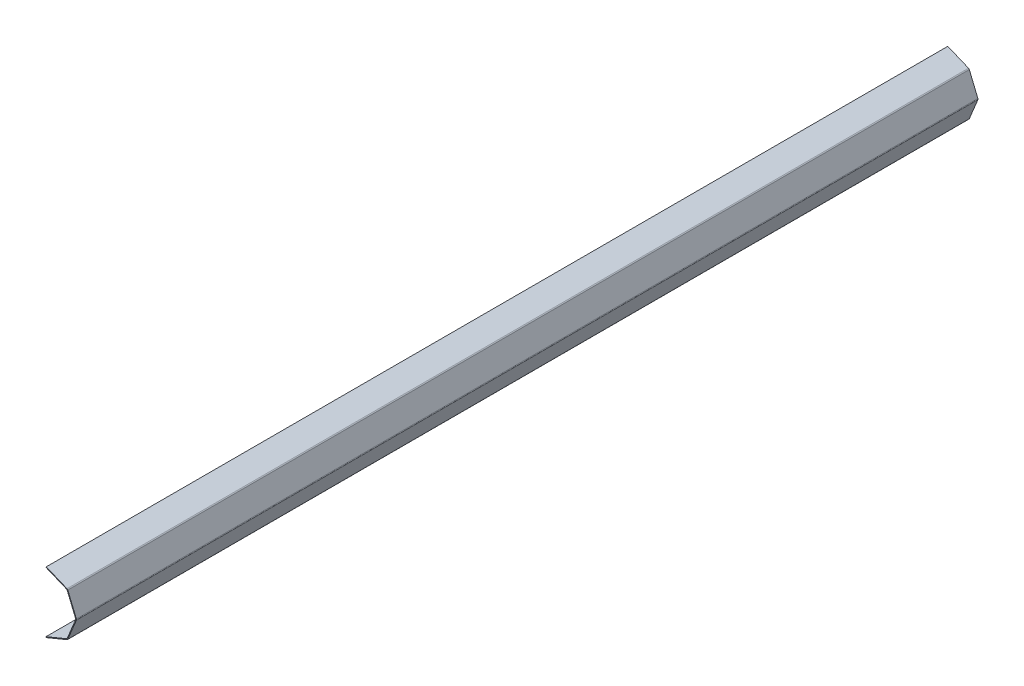
ISO-10303-21;
HEADER;
FILE_DESCRIPTION(('STEP AP214'),'2;1');
FILE_NAME('part.step','',(''),(''),'','','');
FILE_SCHEMA(('AUTOMOTIVE_DESIGN { 1 0 10303 214 1 1 1 1 }'));
ENDSEC;
DATA;
#1=APPLICATION_CONTEXT('core data for automotive mechanical design processes');
#2=APPLICATION_PROTOCOL_DEFINITION('international standard','automotive_design',2000,#1);
#3=PRODUCT_CONTEXT('',#1,'mechanical');
#4=PRODUCT('Part','Part','',(#3));
#5=PRODUCT_RELATED_PRODUCT_CATEGORY('part','',(#4));
#6=PRODUCT_DEFINITION_FORMATION('','',#4);
#7=PRODUCT_DEFINITION_CONTEXT('part definition',#1,'design');
#8=PRODUCT_DEFINITION('design','',#6,#7);
#9=PRODUCT_DEFINITION_SHAPE('','',#8);
#10=(LENGTH_UNIT() NAMED_UNIT(*) SI_UNIT(.MILLI.,.METRE.));
#11=(NAMED_UNIT(*) PLANE_ANGLE_UNIT() SI_UNIT($,.RADIAN.));
#12=(NAMED_UNIT(*) SI_UNIT($,.STERADIAN.) SOLID_ANGLE_UNIT());
#13=UNCERTAINTY_MEASURE_WITH_UNIT(LENGTH_MEASURE(1.E-05),#10,'distance_accuracy_value','');
#14=(GEOMETRIC_REPRESENTATION_CONTEXT(3) GLOBAL_UNCERTAINTY_ASSIGNED_CONTEXT((#13)) GLOBAL_UNIT_ASSIGNED_CONTEXT((#10,
#11,#12)) REPRESENTATION_CONTEXT('',''));
#15=CARTESIAN_POINT('',(0.,0.,0.));
#16=DIRECTION('',(0.,0.,1.));
#17=DIRECTION('',(1.,0.,0.));
#18=AXIS2_PLACEMENT_3D('',#15,#16,#17);
#19=CARTESIAN_POINT('',(139.507939075484,142.213919576215,5990.));
#20=DIRECTION('',(0.,0.,1.));
#21=DIRECTION('',(1.,0.,0.));
#22=AXIS2_PLACEMENT_3D('',#19,#20,#21);
#23=PLANE('',#22);
#24=DIRECTION('',(0.382683432365087,0.923879532511288,0.));
#25=VECTOR('',#24,1.);
#26=CARTESIAN_POINT('',(139.507939075484,142.213919576215,5990.));
#27=LINE('',#26,#25);
#28=CARTESIAN_POINT('',(139.507939075484,142.213919576215,5990.));
#29=VERTEX_POINT('',#28);
#30=CARTESIAN_POINT('',(141.42135623731,146.833317238771,5990.));
#31=VERTEX_POINT('',#30);
#32=EDGE_CURVE('E11',#29,#31,#27,.T.);
#33=ORIENTED_EDGE('',*,*,#32,.F.);
#34=CARTESIAN_POINT('',(137.594521913659,137.594521913659,5990.));
#35=DIRECTION('',(0.,0.,1.));
#36=DIRECTION('',(1.,0.,0.));
#37=AXIS2_PLACEMENT_3D('',#34,#35,#36);
#38=CIRCLE('',#37,5.);
#39=CARTESIAN_POINT('',(142.213919576215,139.507939075484,5990.));
#40=VERTEX_POINT('',#39);
#41=EDGE_CURVE('E306',#29,#40,#38,.F.);
#42=ORIENTED_EDGE('',*,*,#41,.T.);
#43=DIRECTION('',(-0.923879532511283,-0.382683432365099,0.));
#44=VECTOR('',#43,1.);
#45=CARTESIAN_POINT('',(146.833317238772,141.42135623731,5990.));
#46=LINE('',#45,#44);
#47=CARTESIAN_POINT('',(146.833317238772,141.42135623731,5990.));
#48=VERTEX_POINT('',#47);
#49=EDGE_CURVE('E47',#48,#40,#46,.T.);
#50=ORIENTED_EDGE('',*,*,#49,.F.);
#51=CARTESIAN_POINT('',(137.594521913659,137.594521913659,5990.));
#52=DIRECTION('',(0.,0.,1.));
#53=DIRECTION('',(1.,0.,0.));
#54=AXIS2_PLACEMENT_3D('',#51,#52,#53);
#55=CIRCLE('',#54,10.);
#56=EDGE_CURVE('E325',#31,#48,#55,.F.);
#57=ORIENTED_EDGE('',*,*,#56,.F.);
#58=EDGE_LOOP('',(#33,#42,#50,#57));
#59=FACE_BOUND('',#58,.T.);
#60=ADVANCED_FACE('F39',(#59),#23,.T.);
#61=CARTESIAN_POINT('',(146.833317238772,141.42135623731,5990.));
#62=DIRECTION('',(0.,0.,1.));
#63=DIRECTION('',(1.,0.,0.));
#64=AXIS2_PLACEMENT_3D('',#61,#62,#63);
#65=PLANE('',#64);
#66=DIRECTION('',(0.923879532511287,-0.38268343236509,0.));
#67=VECTOR('',#66,1.);
#68=CARTESIAN_POINT('',(1.91341716182544,199.207436661095,5990.));
#69=LINE('',#68,#67);
#70=CARTESIAN_POINT('',(1.91341716182544,199.207436661095,5990.));
#71=VERTEX_POINT('',#70);
#72=EDGE_CURVE('E310',#71,#29,#69,.T.);
#73=ORIENTED_EDGE('',*,*,#72,.T.);
#74=ORIENTED_EDGE('',*,*,#32,.T.);
#75=DIRECTION('',(0.923879532511287,-0.38268343236509,0.));
#76=VECTOR('',#75,1.);
#77=CARTESIAN_POINT('',(3.82683432365089,203.826834323651,5990.));
#78=LINE('',#77,#76);
#79=CARTESIAN_POINT('',(3.82683432365089,203.826834323651,5990.));
#80=VERTEX_POINT('',#79);
#81=EDGE_CURVE('E322',#80,#31,#78,.T.);
#82=ORIENTED_EDGE('',*,*,#81,.F.);
#83=DIRECTION('',(0.382683432365091,0.923879532511286,0.));
#84=VECTOR('',#83,1.);
#85=CARTESIAN_POINT('',(1.91341716182544,199.207436661095,5990.));
#86=LINE('',#85,#84);
#87=EDGE_CURVE('E319',#71,#80,#86,.T.);
#88=ORIENTED_EDGE('',*,*,#87,.F.);
#89=EDGE_LOOP('',(#73,#74,#82,#88));
#90=FACE_BOUND('',#89,.T.);
#91=ADVANCED_FACE('F375',(#90),#65,.T.);
#92=CARTESIAN_POINT('',(142.213919576215,139.507939075484,0.));
#93=DIRECTION('',(0.,0.,-1.));
#94=DIRECTION('',(-1.,0.,0.));
#95=AXIS2_PLACEMENT_3D('',#92,#93,#94);
#96=PLANE('',#95);
#97=DIRECTION('',(0.923879532511283,0.382683432365099,0.));
#98=VECTOR('',#97,1.);
#99=CARTESIAN_POINT('',(142.213919576215,139.507939075484,0.));
#100=LINE('',#99,#98);
#101=CARTESIAN_POINT('',(142.213919576215,139.507939075484,0.));
#102=VERTEX_POINT('',#101);
#103=CARTESIAN_POINT('',(146.833317238772,141.42135623731,0.));
#104=VERTEX_POINT('',#103);
#105=EDGE_CURVE('E292',#102,#104,#100,.T.);
#106=ORIENTED_EDGE('',*,*,#105,.F.);
#107=CARTESIAN_POINT('',(137.594521913659,137.594521913659,0.));
#108=DIRECTION('',(0.,0.,1.));
#109=DIRECTION('',(1.,0.,0.));
#110=AXIS2_PLACEMENT_3D('',#107,#108,#109);
#111=CIRCLE('',#110,5.);
#112=CARTESIAN_POINT('',(139.507939075484,142.213919576215,0.));
#113=VERTEX_POINT('',#112);
#114=EDGE_CURVE('E234',#113,#102,#111,.F.);
#115=ORIENTED_EDGE('',*,*,#114,.F.);
#116=DIRECTION('',(-0.382683432365087,-0.923879532511288,0.));
#117=VECTOR('',#116,1.);
#118=CARTESIAN_POINT('',(141.42135623731,146.833317238771,0.));
#119=LINE('',#118,#117);
#120=CARTESIAN_POINT('',(141.42135623731,146.833317238771,0.));
#121=VERTEX_POINT('',#120);
#122=EDGE_CURVE('E290',#121,#113,#119,.T.);
#123=ORIENTED_EDGE('',*,*,#122,.F.);
#124=CARTESIAN_POINT('',(137.594521913659,137.594521913659,0.));
#125=DIRECTION('',(0.,0.,1.));
#126=DIRECTION('',(1.,0.,0.));
#127=AXIS2_PLACEMENT_3D('',#124,#125,#126);
#128=CIRCLE('',#127,10.);
#129=EDGE_CURVE('E222',#121,#104,#128,.F.);
#130=ORIENTED_EDGE('',*,*,#129,.T.);
#131=EDGE_LOOP('',(#106,#115,#123,#130));
#132=FACE_BOUND('',#131,.T.);
#133=ADVANCED_FACE('F385',(#132),#96,.T.);
#134=CARTESIAN_POINT('',(141.42135623731,146.833317238771,0.));
#135=DIRECTION('',(0.,0.,-1.));
#136=DIRECTION('',(-1.,0.,0.));
#137=AXIS2_PLACEMENT_3D('',#134,#135,#136);
#138=PLANE('',#137);
#139=DIRECTION('',(0.38268343236509,-0.923879532511287,0.));
#140=VECTOR('',#139,1.);
#141=CARTESIAN_POINT('',(200.,0.,0.));
#142=LINE('',#141,#140);
#143=CARTESIAN_POINT('',(199.207436661095,1.91341716182545,0.));
#144=VERTEX_POINT('',#143);
#145=EDGE_CURVE('E237',#102,#144,#142,.T.);
#146=ORIENTED_EDGE('',*,*,#145,.F.);
#147=ORIENTED_EDGE('',*,*,#105,.T.);
#148=DIRECTION('',(0.38268343236509,-0.923879532511287,0.));
#149=VECTOR('',#148,1.);
#150=CARTESIAN_POINT('',(204.619397662556,1.91341716182546,0.));
#151=LINE('',#150,#149);
#152=CARTESIAN_POINT('',(203.826834323651,3.82683432365091,0.));
#153=VERTEX_POINT('',#152);
#154=EDGE_CURVE('E219',#104,#153,#151,.T.);
#155=ORIENTED_EDGE('',*,*,#154,.T.);
#156=DIRECTION('',(-0.923879532511287,-0.38268343236509,0.));
#157=VECTOR('',#156,1.);
#158=CARTESIAN_POINT('',(203.826834323651,3.82683432365091,0.));
#159=LINE('',#158,#157);
#160=EDGE_CURVE('E286',#153,#144,#159,.T.);
#161=ORIENTED_EDGE('',*,*,#160,.T.);
#162=EDGE_LOOP('',(#146,#147,#155,#161));
#163=FACE_BOUND('',#162,.T.);
#164=ADVANCED_FACE('F387',(#163),#138,.T.);
#165=CARTESIAN_POINT('',(199.207436661095,1.91341716182545,5990.));
#166=DIRECTION('',(0.,0.,1.));
#167=DIRECTION('',(1.,0.,0.));
#168=AXIS2_PLACEMENT_3D('',#165,#166,#167);
#169=PLANE('',#168);
#170=DIRECTION('',(0.923879532511287,0.38268343236509,0.));
#171=VECTOR('',#170,1.);
#172=CARTESIAN_POINT('',(199.207436661095,1.91341716182545,5990.));
#173=LINE('',#172,#171);
#174=CARTESIAN_POINT('',(199.207436661095,1.91341716182545,5990.));
#175=VERTEX_POINT('',#174);
#176=CARTESIAN_POINT('',(203.826834323651,3.82683432365091,5990.));
#177=VERTEX_POINT('',#176);
#178=EDGE_CURVE('E172',#175,#177,#173,.T.);
#179=ORIENTED_EDGE('',*,*,#178,.F.);
#180=CARTESIAN_POINT('',(194.588038998538,0.,5990.));
#181=DIRECTION('',(0.,0.,1.));
#182=DIRECTION('',(1.,0.,0.));
#183=AXIS2_PLACEMENT_3D('',#180,#181,#182);
#184=CIRCLE('',#183,5.);
#185=CARTESIAN_POINT('',(199.207436661094,-1.9134171618255,5990.));
#186=VERTEX_POINT('',#185);
#187=EDGE_CURVE('E176',#175,#186,#184,.F.);
#188=ORIENTED_EDGE('',*,*,#187,.T.);
#189=DIRECTION('',(-0.923879532511287,0.382683432365089,0.));
#190=VECTOR('',#189,1.);
#191=CARTESIAN_POINT('',(203.826834323651,-3.82683432365094,5990.));
#192=LINE('',#191,#190);
#193=CARTESIAN_POINT('',(203.826834323651,-3.82683432365094,5990.));
#194=VERTEX_POINT('',#193);
#195=EDGE_CURVE('E160',#194,#186,#192,.T.);
#196=ORIENTED_EDGE('',*,*,#195,.F.);
#197=CARTESIAN_POINT('',(194.588038998538,0.,5990.));
#198=DIRECTION('',(0.,0.,1.));
#199=DIRECTION('',(1.,0.,0.));
#200=AXIS2_PLACEMENT_3D('',#197,#198,#199);
#201=CIRCLE('',#200,10.);
#202=EDGE_CURVE('E328',#177,#194,#201,.F.);
#203=ORIENTED_EDGE('',*,*,#202,.F.);
#204=EDGE_LOOP('',(#179,#188,#196,#203));
#205=FACE_BOUND('',#204,.T.);
#206=ADVANCED_FACE('F178',(#205),#169,.T.);
#207=CARTESIAN_POINT('',(203.826834323651,-3.82683432365094,5990.));
#208=DIRECTION('',(0.,0.,1.));
#209=DIRECTION('',(1.,0.,0.));
#210=AXIS2_PLACEMENT_3D('',#207,#208,#209);
#211=PLANE('',#210);
#212=DIRECTION('',(0.38268343236509,-0.923879532511287,0.));
#213=VECTOR('',#212,1.);
#214=CARTESIAN_POINT('',(200.,0.,5990.));
#215=LINE('',#214,#213);
#216=EDGE_CURVE('E182',#40,#175,#215,.T.);
#217=ORIENTED_EDGE('',*,*,#216,.T.);
#218=ORIENTED_EDGE('',*,*,#178,.T.);
#219=DIRECTION('',(0.38268343236509,-0.923879532511287,0.));
#220=VECTOR('',#219,1.);
#221=CARTESIAN_POINT('',(204.619397662556,1.91341716182546,5990.));
#222=LINE('',#221,#220);
#223=EDGE_CURVE('E300',#48,#177,#222,.T.);
#224=ORIENTED_EDGE('',*,*,#223,.F.);
#225=ORIENTED_EDGE('',*,*,#49,.T.);
#226=EDGE_LOOP('',(#217,#218,#224,#225));
#227=FACE_BOUND('',#226,.T.);
#228=ADVANCED_FACE('F296',(#227),#211,.T.);
#229=CARTESIAN_POINT('',(199.207436661094,-1.9134171618255,0.));
#230=DIRECTION('',(0.,0.,-1.));
#231=DIRECTION('',(-1.,0.,0.));
#232=AXIS2_PLACEMENT_3D('',#229,#230,#231);
#233=PLANE('',#232);
#234=DIRECTION('',(0.923879532511287,-0.382683432365089,0.));
#235=VECTOR('',#234,1.);
#236=CARTESIAN_POINT('',(199.207436661094,-1.9134171618255,0.));
#237=LINE('',#236,#235);
#238=CARTESIAN_POINT('',(199.207436661094,-1.9134171618255,0.));
#239=VERTEX_POINT('',#238);
#240=CARTESIAN_POINT('',(203.826834323651,-3.82683432365094,0.));
#241=VERTEX_POINT('',#240);
#242=EDGE_CURVE('E173',#239,#241,#237,.T.);
#243=ORIENTED_EDGE('',*,*,#242,.F.);
#244=CARTESIAN_POINT('',(194.588038998538,0.,0.));
#245=DIRECTION('',(0.,0.,1.));
#246=DIRECTION('',(1.,0.,0.));
#247=AXIS2_PLACEMENT_3D('',#244,#245,#246);
#248=CIRCLE('',#247,5.);
#249=EDGE_CURVE('E189',#144,#239,#248,.F.);
#250=ORIENTED_EDGE('',*,*,#249,.F.);
#251=ORIENTED_EDGE('',*,*,#160,.F.);
#252=CARTESIAN_POINT('',(194.588038998538,0.,0.));
#253=DIRECTION('',(0.,0.,1.));
#254=DIRECTION('',(1.,0.,0.));
#255=AXIS2_PLACEMENT_3D('',#252,#253,#254);
#256=CIRCLE('',#255,10.);
#257=EDGE_CURVE('E216',#153,#241,#256,.F.);
#258=ORIENTED_EDGE('',*,*,#257,.T.);
#259=EDGE_LOOP('',(#243,#250,#251,#258));
#260=FACE_BOUND('',#259,.T.);
#261=ADVANCED_FACE('F389',(#260),#233,.T.);
#262=CARTESIAN_POINT('',(203.826834323651,3.82683432365091,0.));
#263=DIRECTION('',(0.,0.,-1.));
#264=DIRECTION('',(-1.,0.,0.));
#265=AXIS2_PLACEMENT_3D('',#262,#263,#264);
#266=PLANE('',#265);
#267=DIRECTION('',(-0.38268343236509,-0.923879532511287,0.));
#268=VECTOR('',#267,1.);
#269=CARTESIAN_POINT('',(141.42135623731,-141.42135623731,0.));
#270=LINE('',#269,#268);
#271=CARTESIAN_POINT('',(142.213919576215,-139.507939075484,0.));
#272=VERTEX_POINT('',#271);
#273=EDGE_CURVE('E241',#239,#272,#270,.T.);
#274=ORIENTED_EDGE('',*,*,#273,.F.);
#275=ORIENTED_EDGE('',*,*,#242,.T.);
#276=DIRECTION('',(-0.38268343236509,-0.923879532511287,0.));
#277=VECTOR('',#276,1.);
#278=CARTESIAN_POINT('',(146.040753899866,-143.334773399135,0.));
#279=LINE('',#278,#277);
#280=CARTESIAN_POINT('',(146.833317238772,-141.42135623731,0.));
#281=VERTEX_POINT('',#280);
#282=EDGE_CURVE('E214',#241,#281,#279,.T.);
#283=ORIENTED_EDGE('',*,*,#282,.T.);
#284=DIRECTION('',(-0.923879532511288,0.382683432365087,0.));
#285=VECTOR('',#284,1.);
#286=CARTESIAN_POINT('',(146.833317238772,-141.42135623731,0.));
#287=LINE('',#286,#285);
#288=EDGE_CURVE('E108',#281,#272,#287,.T.);
#289=ORIENTED_EDGE('',*,*,#288,.T.);
#290=EDGE_LOOP('',(#274,#275,#283,#289));
#291=FACE_BOUND('',#290,.T.);
#292=ADVANCED_FACE('F390',(#291),#266,.T.);
#293=CARTESIAN_POINT('',(142.213919576215,-139.507939075484,5990.));
#294=DIRECTION('',(0.,0.,1.));
#295=DIRECTION('',(1.,0.,0.));
#296=AXIS2_PLACEMENT_3D('',#293,#294,#295);
#297=PLANE('',#296);
#298=DIRECTION('',(0.923879532511288,-0.382683432365087,0.));
#299=VECTOR('',#298,1.);
#300=CARTESIAN_POINT('',(142.213919576215,-139.507939075484,5990.));
#301=LINE('',#300,#299);
#302=CARTESIAN_POINT('',(142.213919576215,-139.507939075484,5990.));
#303=VERTEX_POINT('',#302);
#304=CARTESIAN_POINT('',(146.833317238772,-141.42135623731,5990.));
#305=VERTEX_POINT('',#304);
#306=EDGE_CURVE('E284',#303,#305,#301,.T.);
#307=ORIENTED_EDGE('',*,*,#306,.F.);
#308=CARTESIAN_POINT('',(137.594521913659,-137.594521913659,5990.));
#309=DIRECTION('',(0.,0.,1.));
#310=DIRECTION('',(1.,0.,0.));
#311=AXIS2_PLACEMENT_3D('',#308,#309,#310);
#312=CIRCLE('',#311,5.);
#313=CARTESIAN_POINT('',(139.507939075484,-142.213919576215,5990.));
#314=VERTEX_POINT('',#313);
#315=EDGE_CURVE('E197',#303,#314,#312,.F.);
#316=ORIENTED_EDGE('',*,*,#315,.T.);
#317=DIRECTION('',(-0.382683432365089,0.923879532511287,0.));
#318=VECTOR('',#317,1.);
#319=CARTESIAN_POINT('',(141.42135623731,-146.833317238772,5990.));
#320=LINE('',#319,#318);
#321=CARTESIAN_POINT('',(141.42135623731,-146.833317238772,5990.));
#322=VERTEX_POINT('',#321);
#323=EDGE_CURVE('E55',#322,#314,#320,.T.);
#324=ORIENTED_EDGE('',*,*,#323,.F.);
#325=CARTESIAN_POINT('',(137.594521913659,-137.594521913659,5990.));
#326=DIRECTION('',(0.,0.,1.));
#327=DIRECTION('',(1.,0.,0.));
#328=AXIS2_PLACEMENT_3D('',#325,#326,#327);
#329=CIRCLE('',#328,10.);
#330=EDGE_CURVE('E331',#305,#322,#329,.F.);
#331=ORIENTED_EDGE('',*,*,#330,.F.);
#332=EDGE_LOOP('',(#307,#316,#324,#331));
#333=FACE_BOUND('',#332,.T.);
#334=ADVANCED_FACE('F354',(#333),#297,.T.);
#335=CARTESIAN_POINT('',(141.42135623731,-146.833317238772,5990.));
#336=DIRECTION('',(0.,0.,1.));
#337=DIRECTION('',(1.,0.,0.));
#338=AXIS2_PLACEMENT_3D('',#335,#336,#337);
#339=PLANE('',#338);
#340=DIRECTION('',(-0.38268343236509,-0.923879532511287,0.));
#341=VECTOR('',#340,1.);
#342=CARTESIAN_POINT('',(141.42135623731,-141.42135623731,5990.));
#343=LINE('',#342,#341);
#344=EDGE_CURVE('E164',#186,#303,#343,.T.);
#345=ORIENTED_EDGE('',*,*,#344,.T.);
#346=ORIENTED_EDGE('',*,*,#306,.T.);
#347=DIRECTION('',(-0.38268343236509,-0.923879532511287,0.));
#348=VECTOR('',#347,1.);
#349=CARTESIAN_POINT('',(146.040753899866,-143.334773399135,5990.));
#350=LINE('',#349,#348);
#351=EDGE_CURVE('E167',#194,#305,#350,.T.);
#352=ORIENTED_EDGE('',*,*,#351,.F.);
#353=ORIENTED_EDGE('',*,*,#195,.T.);
#354=EDGE_LOOP('',(#345,#346,#352,#353));
#355=FACE_BOUND('',#354,.T.);
#356=ADVANCED_FACE('F162',(#355),#339,.T.);
#357=CARTESIAN_POINT('',(139.507939075484,-142.213919576215,0.));
#358=DIRECTION('',(0.,0.,-1.));
#359=DIRECTION('',(-1.,0.,0.));
#360=AXIS2_PLACEMENT_3D('',#357,#358,#359);
#361=PLANE('',#360);
#362=DIRECTION('',(0.382683432365089,-0.923879532511287,0.));
#363=VECTOR('',#362,1.);
#364=CARTESIAN_POINT('',(139.507939075484,-142.213919576215,0.));
#365=LINE('',#364,#363);
#366=CARTESIAN_POINT('',(139.507939075484,-142.213919576215,0.));
#367=VERTEX_POINT('',#366);
#368=CARTESIAN_POINT('',(141.42135623731,-146.833317238772,0.));
#369=VERTEX_POINT('',#368);
#370=EDGE_CURVE('E115',#367,#369,#365,.T.);
#371=ORIENTED_EDGE('',*,*,#370,.F.);
#372=CARTESIAN_POINT('',(137.594521913659,-137.594521913659,0.));
#373=DIRECTION('',(0.,0.,1.));
#374=DIRECTION('',(1.,0.,0.));
#375=AXIS2_PLACEMENT_3D('',#372,#373,#374);
#376=CIRCLE('',#375,5.);
#377=EDGE_CURVE('E243',#272,#367,#376,.F.);
#378=ORIENTED_EDGE('',*,*,#377,.F.);
#379=ORIENTED_EDGE('',*,*,#288,.F.);
#380=CARTESIAN_POINT('',(137.594521913659,-137.594521913659,0.));
#381=DIRECTION('',(0.,0.,1.));
#382=DIRECTION('',(1.,0.,0.));
#383=AXIS2_PLACEMENT_3D('',#380,#381,#382);
#384=CIRCLE('',#383,10.);
#385=EDGE_CURVE('E212',#281,#369,#384,.F.);
#386=ORIENTED_EDGE('',*,*,#385,.T.);
#387=EDGE_LOOP('',(#371,#378,#379,#386));
#388=FACE_BOUND('',#387,.T.);
#389=ADVANCED_FACE('F394',(#388),#361,.T.);
#390=CARTESIAN_POINT('',(146.833317238772,-141.42135623731,0.));
#391=DIRECTION('',(0.,0.,-1.));
#392=DIRECTION('',(-1.,0.,0.));
#393=AXIS2_PLACEMENT_3D('',#390,#391,#392);
#394=PLANE('',#393);
#395=DIRECTION('',(-0.923879532511287,-0.382683432365089,0.));
#396=VECTOR('',#395,1.);
#397=CARTESIAN_POINT('',(141.42135623731,-141.42135623731,0.));
#398=LINE('',#397,#396);
#399=CARTESIAN_POINT('',(1.91341716182541,-199.207436661094,0.));
#400=VERTEX_POINT('',#399);
#401=EDGE_CURVE('E203',#367,#400,#398,.T.);
#402=ORIENTED_EDGE('',*,*,#401,.F.);
#403=ORIENTED_EDGE('',*,*,#370,.T.);
#404=DIRECTION('',(-0.923879532511287,-0.382683432365089,0.));
#405=VECTOR('',#404,1.);
#406=CARTESIAN_POINT('',(143.334773399135,-146.040753899866,0.));
#407=LINE('',#406,#405);
#408=CARTESIAN_POINT('',(3.82683432365083,-203.826834323651,0.));
#409=VERTEX_POINT('',#408);
#410=EDGE_CURVE('E209',#369,#409,#407,.T.);
#411=ORIENTED_EDGE('',*,*,#410,.T.);
#412=DIRECTION('',(-0.382683432365086,0.923879532511288,0.));
#413=VECTOR('',#412,1.);
#414=CARTESIAN_POINT('',(3.82683432365083,-203.826834323651,0.));
#415=LINE('',#414,#413);
#416=EDGE_CURVE('E206',#409,#400,#415,.T.);
#417=ORIENTED_EDGE('',*,*,#416,.T.);
#418=EDGE_LOOP('',(#402,#403,#411,#417));
#419=FACE_BOUND('',#418,.T.);
#420=ADVANCED_FACE('F396',(#419),#394,.T.);
#421=CARTESIAN_POINT('',(141.42135623731,-141.42135623731,5990.));
#422=DIRECTION('',(0.382683432365089,-0.923879532511287,0.));
#423=DIRECTION('',(0.923879532511287,0.382683432365089,0.));
#424=AXIS2_PLACEMENT_3D('',#421,#422,#423);
#425=PLANE('',#424);
#426=ORIENTED_EDGE('',*,*,#401,.T.);
#427=DIRECTION('',(0.,0.,-1.));
#428=VECTOR('',#427,1.);
#429=CARTESIAN_POINT('',(1.91341716182541,-199.207436661094,5990.));
#430=LINE('',#429,#428);
#431=CARTESIAN_POINT('',(1.91341716182541,-199.207436661094,5990.));
#432=VERTEX_POINT('',#431);
#433=EDGE_CURVE('E279',#432,#400,#430,.T.);
#434=ORIENTED_EDGE('',*,*,#433,.F.);
#435=DIRECTION('',(-0.923879532511287,-0.382683432365089,0.));
#436=VECTOR('',#435,1.);
#437=CARTESIAN_POINT('',(141.42135623731,-141.42135623731,5990.));
#438=LINE('',#437,#436);
#439=EDGE_CURVE('E121',#314,#432,#438,.T.);
#440=ORIENTED_EDGE('',*,*,#439,.F.);
#441=DIRECTION('',(0.,0.,-1.));
#442=VECTOR('',#441,1.);
#443=CARTESIAN_POINT('',(139.507939075484,-142.213919576215,5990.));
#444=LINE('',#443,#442);
#445=EDGE_CURVE('E199',#314,#367,#444,.T.);
#446=ORIENTED_EDGE('',*,*,#445,.T.);
#447=EDGE_LOOP('',(#426,#434,#440,#446));
#448=FACE_BOUND('',#447,.T.);
#449=ADVANCED_FACE('F402',(#448),#425,.F.);
#450=CARTESIAN_POINT('',(3.82683432365083,-203.826834323651,5990.));
#451=DIRECTION('',(-0.923879532511288,-0.382683432365086,0.));
#452=DIRECTION('',(0.382683432365086,-0.923879532511288,0.));
#453=AXIS2_PLACEMENT_3D('',#450,#451,#452);
#454=PLANE('',#453);
#455=ORIENTED_EDGE('',*,*,#416,.F.);
#456=DIRECTION('',(0.,0.,-1.));
#457=VECTOR('',#456,1.);
#458=CARTESIAN_POINT('',(3.82683432365083,-203.826834323651,5990.));
#459=LINE('',#458,#457);
#460=CARTESIAN_POINT('',(3.82683432365083,-203.826834323651,5990.));
#461=VERTEX_POINT('',#460);
#462=EDGE_CURVE('E277',#461,#409,#459,.T.);
#463=ORIENTED_EDGE('',*,*,#462,.F.);
#464=DIRECTION('',(-0.382683432365086,0.923879532511288,0.));
#465=VECTOR('',#464,1.);
#466=CARTESIAN_POINT('',(3.82683432365083,-203.826834323651,5990.));
#467=LINE('',#466,#465);
#468=EDGE_CURVE('E337',#461,#432,#467,.T.);
#469=ORIENTED_EDGE('',*,*,#468,.T.);
#470=ORIENTED_EDGE('',*,*,#433,.T.);
#471=EDGE_LOOP('',(#455,#463,#469,#470));
#472=FACE_BOUND('',#471,.T.);
#473=ADVANCED_FACE('F342',(#472),#454,.T.);
#474=CARTESIAN_POINT('',(143.334773399135,-146.040753899866,5990.));
#475=DIRECTION('',(0.382683432365089,-0.923879532511287,0.));
#476=DIRECTION('',(0.923879532511287,0.382683432365089,0.));
#477=AXIS2_PLACEMENT_3D('',#474,#475,#476);
#478=PLANE('',#477);
#479=ORIENTED_EDGE('',*,*,#410,.F.);
#480=DIRECTION('',(0.,0.,-1.));
#481=VECTOR('',#480,1.);
#482=CARTESIAN_POINT('',(141.42135623731,-146.833317238772,5990.));
#483=LINE('',#482,#481);
#484=EDGE_CURVE('E274',#322,#369,#483,.T.);
#485=ORIENTED_EDGE('',*,*,#484,.F.);
#486=DIRECTION('',(-0.923879532511287,-0.382683432365089,0.));
#487=VECTOR('',#486,1.);
#488=CARTESIAN_POINT('',(143.334773399135,-146.040753899866,5990.));
#489=LINE('',#488,#487);
#490=EDGE_CURVE('E334',#322,#461,#489,.T.);
#491=ORIENTED_EDGE('',*,*,#490,.T.);
#492=ORIENTED_EDGE('',*,*,#462,.T.);
#493=EDGE_LOOP('',(#479,#485,#491,#492));
#494=FACE_BOUND('',#493,.T.);
#495=ADVANCED_FACE('F347',(#494),#478,.T.);
#496=CARTESIAN_POINT('',(137.594521913659,-137.594521913659,5990.));
#497=DIRECTION('',(0.,0.,-1.));
#498=DIRECTION('',(-1.,0.,0.));
#499=AXIS2_PLACEMENT_3D('',#496,#497,#498);
#500=CYLINDRICAL_SURFACE('',#499,10.);
#501=ORIENTED_EDGE('',*,*,#385,.F.);
#502=DIRECTION('',(0.,0.,-1.));
#503=VECTOR('',#502,1.);
#504=CARTESIAN_POINT('',(146.833317238772,-141.42135623731,5990.));
#505=LINE('',#504,#503);
#506=EDGE_CURVE('E271',#305,#281,#505,.T.);
#507=ORIENTED_EDGE('',*,*,#506,.F.);
#508=ORIENTED_EDGE('',*,*,#330,.T.);
#509=ORIENTED_EDGE('',*,*,#484,.T.);
#510=EDGE_LOOP('',(#501,#507,#508,#509));
#511=FACE_BOUND('',#510,.T.);
#512=ADVANCED_FACE('F350',(#511),#500,.T.);
#513=CARTESIAN_POINT('',(146.040753899866,-143.334773399135,5990.));
#514=DIRECTION('',(0.923879532511287,-0.38268343236509,0.));
#515=DIRECTION('',(0.38268343236509,0.923879532511287,0.));
#516=AXIS2_PLACEMENT_3D('',#513,#514,#515);
#517=PLANE('',#516);
#518=ORIENTED_EDGE('',*,*,#282,.F.);
#519=DIRECTION('',(0.,0.,-1.));
#520=VECTOR('',#519,1.);
#521=CARTESIAN_POINT('',(203.826834323651,-3.82683432365094,5990.));
#522=LINE('',#521,#520);
#523=EDGE_CURVE('E268',#194,#241,#522,.T.);
#524=ORIENTED_EDGE('',*,*,#523,.F.);
#525=ORIENTED_EDGE('',*,*,#351,.T.);
#526=ORIENTED_EDGE('',*,*,#506,.T.);
#527=EDGE_LOOP('',(#518,#524,#525,#526));
#528=FACE_BOUND('',#527,.T.);
#529=ADVANCED_FACE('F357',(#528),#517,.T.);
#530=CARTESIAN_POINT('',(194.588038998538,0.,5990.));
#531=DIRECTION('',(0.,0.,-1.));
#532=DIRECTION('',(-1.,0.,0.));
#533=AXIS2_PLACEMENT_3D('',#530,#531,#532);
#534=CYLINDRICAL_SURFACE('',#533,10.);
#535=ORIENTED_EDGE('',*,*,#257,.F.);
#536=DIRECTION('',(0.,0.,-1.));
#537=VECTOR('',#536,1.);
#538=CARTESIAN_POINT('',(203.826834323651,3.82683432365091,5990.));
#539=LINE('',#538,#537);
#540=EDGE_CURVE('E265',#177,#153,#539,.T.);
#541=ORIENTED_EDGE('',*,*,#540,.F.);
#542=ORIENTED_EDGE('',*,*,#202,.T.);
#543=ORIENTED_EDGE('',*,*,#523,.T.);
#544=EDGE_LOOP('',(#535,#541,#542,#543));
#545=FACE_BOUND('',#544,.T.);
#546=ADVANCED_FACE('F360',(#545),#534,.T.);
#547=CARTESIAN_POINT('',(204.619397662556,1.91341716182546,5990.));
#548=DIRECTION('',(0.923879532511287,0.38268343236509,0.));
#549=DIRECTION('',(-0.38268343236509,0.923879532511287,0.));
#550=AXIS2_PLACEMENT_3D('',#547,#548,#549);
#551=PLANE('',#550);
#552=ORIENTED_EDGE('',*,*,#154,.F.);
#553=DIRECTION('',(0.,0.,-1.));
#554=VECTOR('',#553,1.);
#555=CARTESIAN_POINT('',(146.833317238772,141.42135623731,5990.));
#556=LINE('',#555,#554);
#557=EDGE_CURVE('E262',#48,#104,#556,.T.);
#558=ORIENTED_EDGE('',*,*,#557,.F.);
#559=ORIENTED_EDGE('',*,*,#223,.T.);
#560=ORIENTED_EDGE('',*,*,#540,.T.);
#561=EDGE_LOOP('',(#552,#558,#559,#560));
#562=FACE_BOUND('',#561,.T.);
#563=ADVANCED_FACE('F364',(#562),#551,.T.);
#564=CARTESIAN_POINT('',(137.594521913659,137.594521913659,5990.));
#565=DIRECTION('',(0.,0.,-1.));
#566=DIRECTION('',(-1.,0.,0.));
#567=AXIS2_PLACEMENT_3D('',#564,#565,#566);
#568=CYLINDRICAL_SURFACE('',#567,10.);
#569=ORIENTED_EDGE('',*,*,#129,.F.);
#570=DIRECTION('',(0.,0.,-1.));
#571=VECTOR('',#570,1.);
#572=CARTESIAN_POINT('',(141.42135623731,146.833317238771,5990.));
#573=LINE('',#572,#571);
#574=EDGE_CURVE('E259',#31,#121,#573,.T.);
#575=ORIENTED_EDGE('',*,*,#574,.F.);
#576=ORIENTED_EDGE('',*,*,#56,.T.);
#577=ORIENTED_EDGE('',*,*,#557,.T.);
#578=EDGE_LOOP('',(#569,#575,#576,#577));
#579=FACE_BOUND('',#578,.T.);
#580=ADVANCED_FACE('F367',(#579),#568,.T.);
#581=CARTESIAN_POINT('',(3.82683432365089,203.826834323651,5990.));
#582=DIRECTION('',(0.38268343236509,0.923879532511287,0.));
#583=DIRECTION('',(-0.923879532511287,0.38268343236509,0.));
#584=AXIS2_PLACEMENT_3D('',#581,#582,#583);
#585=PLANE('',#584);
#586=DIRECTION('',(0.923879532511287,-0.38268343236509,0.));
#587=VECTOR('',#586,1.);
#588=CARTESIAN_POINT('',(3.82683432365089,203.826834323651,0.));
#589=LINE('',#588,#587);
#590=CARTESIAN_POINT('',(3.82683432365089,203.826834323651,0.));
#591=VERTEX_POINT('',#590);
#592=EDGE_CURVE('E225',#591,#121,#589,.T.);
#593=ORIENTED_EDGE('',*,*,#592,.F.);
#594=DIRECTION('',(0.,0.,-1.));
#595=VECTOR('',#594,1.);
#596=CARTESIAN_POINT('',(3.82683432365089,203.826834323651,5990.));
#597=LINE('',#596,#595);
#598=EDGE_CURVE('E257',#80,#591,#597,.T.);
#599=ORIENTED_EDGE('',*,*,#598,.F.);
#600=ORIENTED_EDGE('',*,*,#81,.T.);
#601=ORIENTED_EDGE('',*,*,#574,.T.);
#602=EDGE_LOOP('',(#593,#599,#600,#601));
#603=FACE_BOUND('',#602,.T.);
#604=ADVANCED_FACE('F372',(#603),#585,.T.);
#605=CARTESIAN_POINT('',(1.91341716182544,199.207436661095,5990.));
#606=DIRECTION('',(-0.923879532511286,0.382683432365091,0.));
#607=DIRECTION('',(-0.382683432365091,-0.923879532511286,0.));
#608=AXIS2_PLACEMENT_3D('',#605,#606,#607);
#609=PLANE('',#608);
#610=DIRECTION('',(0.382683432365091,0.923879532511286,0.));
#611=VECTOR('',#610,1.);
#612=CARTESIAN_POINT('',(1.91341716182544,199.207436661095,0.));
#613=LINE('',#612,#611);
#614=CARTESIAN_POINT('',(1.91341716182544,199.207436661095,0.));
#615=VERTEX_POINT('',#614);
#616=EDGE_CURVE('E228',#615,#591,#613,.T.);
#617=ORIENTED_EDGE('',*,*,#616,.F.);
#618=DIRECTION('',(0.,0.,-1.));
#619=VECTOR('',#618,1.);
#620=CARTESIAN_POINT('',(1.91341716182544,199.207436661095,5990.));
#621=LINE('',#620,#619);
#622=EDGE_CURVE('E255',#71,#615,#621,.T.);
#623=ORIENTED_EDGE('',*,*,#622,.F.);
#624=ORIENTED_EDGE('',*,*,#87,.T.);
#625=ORIENTED_EDGE('',*,*,#598,.T.);
#626=EDGE_LOOP('',(#617,#623,#624,#625));
#627=FACE_BOUND('',#626,.T.);
#628=ADVANCED_FACE('F378',(#627),#609,.T.);
#629=CARTESIAN_POINT('',(1.91341716182544,199.207436661095,5990.));
#630=DIRECTION('',(0.38268343236509,0.923879532511287,0.));
#631=DIRECTION('',(-0.923879532511287,0.38268343236509,0.));
#632=AXIS2_PLACEMENT_3D('',#629,#630,#631);
#633=PLANE('',#632);
#634=DIRECTION('',(0.923879532511287,-0.38268343236509,0.));
#635=VECTOR('',#634,1.);
#636=CARTESIAN_POINT('',(1.91341716182544,199.207436661095,0.));
#637=LINE('',#636,#635);
#638=EDGE_CURVE('E231',#615,#113,#637,.T.);
#639=ORIENTED_EDGE('',*,*,#638,.T.);
#640=DIRECTION('',(0.,0.,-1.));
#641=VECTOR('',#640,1.);
#642=CARTESIAN_POINT('',(139.507939075484,142.213919576215,5990.));
#643=LINE('',#642,#641);
#644=EDGE_CURVE('E252',#29,#113,#643,.T.);
#645=ORIENTED_EDGE('',*,*,#644,.F.);
#646=ORIENTED_EDGE('',*,*,#72,.F.);
#647=ORIENTED_EDGE('',*,*,#622,.T.);
#648=EDGE_LOOP('',(#639,#645,#646,#647));
#649=FACE_BOUND('',#648,.T.);
#650=ADVANCED_FACE('F383',(#649),#633,.F.);
#651=CARTESIAN_POINT('',(137.594521913659,137.594521913659,5990.));
#652=DIRECTION('',(0.,0.,-1.));
#653=DIRECTION('',(-1.,0.,0.));
#654=AXIS2_PLACEMENT_3D('',#651,#652,#653);
#655=CYLINDRICAL_SURFACE('',#654,5.);
#656=ORIENTED_EDGE('',*,*,#114,.T.);
#657=DIRECTION('',(0.,0.,-1.));
#658=VECTOR('',#657,1.);
#659=CARTESIAN_POINT('',(142.213919576215,139.507939075484,5990.));
#660=LINE('',#659,#658);
#661=EDGE_CURVE('E249',#40,#102,#660,.T.);
#662=ORIENTED_EDGE('',*,*,#661,.F.);
#663=ORIENTED_EDGE('',*,*,#41,.F.);
#664=ORIENTED_EDGE('',*,*,#644,.T.);
#665=EDGE_LOOP('',(#656,#662,#663,#664));
#666=FACE_BOUND('',#665,.T.);
#667=ADVANCED_FACE('F312',(#666),#655,.F.);
#668=CARTESIAN_POINT('',(200.,0.,5990.));
#669=DIRECTION('',(0.923879532511287,0.38268343236509,0.));
#670=DIRECTION('',(-0.38268343236509,0.923879532511287,0.));
#671=AXIS2_PLACEMENT_3D('',#668,#669,#670);
#672=PLANE('',#671);
#673=ORIENTED_EDGE('',*,*,#145,.T.);
#674=DIRECTION('',(0.,0.,-1.));
#675=VECTOR('',#674,1.);
#676=CARTESIAN_POINT('',(199.207436661095,1.91341716182545,5990.));
#677=LINE('',#676,#675);
#678=EDGE_CURVE('E191',#175,#144,#677,.T.);
#679=ORIENTED_EDGE('',*,*,#678,.F.);
#680=ORIENTED_EDGE('',*,*,#216,.F.);
#681=ORIENTED_EDGE('',*,*,#661,.T.);
#682=EDGE_LOOP('',(#673,#679,#680,#681));
#683=FACE_BOUND('',#682,.T.);
#684=ADVANCED_FACE('F316',(#683),#672,.F.);
#685=CARTESIAN_POINT('',(194.588038998538,0.,5990.));
#686=DIRECTION('',(0.,0.,-1.));
#687=DIRECTION('',(-1.,0.,0.));
#688=AXIS2_PLACEMENT_3D('',#685,#686,#687);
#689=CYLINDRICAL_SURFACE('',#688,5.);
#690=ORIENTED_EDGE('',*,*,#249,.T.);
#691=DIRECTION('',(0.,0.,-1.));
#692=VECTOR('',#691,1.);
#693=CARTESIAN_POINT('',(199.207436661094,-1.9134171618255,5990.));
#694=LINE('',#693,#692);
#695=EDGE_CURVE('E186',#186,#239,#694,.T.);
#696=ORIENTED_EDGE('',*,*,#695,.F.);
#697=ORIENTED_EDGE('',*,*,#187,.F.);
#698=ORIENTED_EDGE('',*,*,#678,.T.);
#699=EDGE_LOOP('',(#690,#696,#697,#698));
#700=FACE_BOUND('',#699,.T.);
#701=ADVANCED_FACE('F187',(#700),#689,.F.);
#702=CARTESIAN_POINT('',(141.42135623731,-141.42135623731,5990.));
#703=DIRECTION('',(0.923879532511287,-0.38268343236509,0.));
#704=DIRECTION('',(0.38268343236509,0.923879532511287,0.));
#705=AXIS2_PLACEMENT_3D('',#702,#703,#704);
#706=PLANE('',#705);
#707=ORIENTED_EDGE('',*,*,#273,.T.);
#708=DIRECTION('',(0.,0.,-1.));
#709=VECTOR('',#708,1.);
#710=CARTESIAN_POINT('',(142.213919576215,-139.507939075484,5990.));
#711=LINE('',#710,#709);
#712=EDGE_CURVE('E192',#303,#272,#711,.T.);
#713=ORIENTED_EDGE('',*,*,#712,.F.);
#714=ORIENTED_EDGE('',*,*,#344,.F.);
#715=ORIENTED_EDGE('',*,*,#695,.T.);
#716=EDGE_LOOP('',(#707,#713,#714,#715));
#717=FACE_BOUND('',#716,.T.);
#718=ADVANCED_FACE('F194',(#717),#706,.F.);
#719=CARTESIAN_POINT('',(137.594521913659,-137.594521913659,5990.));
#720=DIRECTION('',(0.,0.,-1.));
#721=DIRECTION('',(-1.,0.,0.));
#722=AXIS2_PLACEMENT_3D('',#719,#720,#721);
#723=CYLINDRICAL_SURFACE('',#722,5.);
#724=ORIENTED_EDGE('',*,*,#377,.T.);
#725=ORIENTED_EDGE('',*,*,#445,.F.);
#726=ORIENTED_EDGE('',*,*,#315,.F.);
#727=ORIENTED_EDGE('',*,*,#712,.T.);
#728=EDGE_LOOP('',(#724,#725,#726,#727));
#729=FACE_BOUND('',#728,.T.);
#730=ADVANCED_FACE('F392',(#729),#723,.F.);
#731=CARTESIAN_POINT('',(137.594521913659,-137.594521913659,5990.));
#732=DIRECTION('',(0.,0.,1.));
#733=DIRECTION('',(1.,0.,0.));
#734=AXIS2_PLACEMENT_3D('',#731,#732,#733);
#735=PLANE('',#734);
#736=ORIENTED_EDGE('',*,*,#439,.T.);
#737=ORIENTED_EDGE('',*,*,#468,.F.);
#738=ORIENTED_EDGE('',*,*,#490,.F.);
#739=ORIENTED_EDGE('',*,*,#323,.T.);
#740=EDGE_LOOP('',(#736,#737,#738,#739));
#741=FACE_BOUND('',#740,.T.);
#742=ADVANCED_FACE('F343',(#741),#735,.T.);
#743=CARTESIAN_POINT('',(137.594521913659,-137.594521913659,0.));
#744=DIRECTION('',(0.,0.,1.));
#745=DIRECTION('',(1.,0.,0.));
#746=AXIS2_PLACEMENT_3D('',#743,#744,#745);
#747=PLANE('',#746);
#748=ORIENTED_EDGE('',*,*,#592,.T.);
#749=ORIENTED_EDGE('',*,*,#122,.T.);
#750=ORIENTED_EDGE('',*,*,#638,.F.);
#751=ORIENTED_EDGE('',*,*,#616,.T.);
#752=EDGE_LOOP('',(#748,#749,#750,#751));
#753=FACE_BOUND('',#752,.T.);
#754=ADVANCED_FACE('F601',(#753),#747,.F.);
#755=CLOSED_SHELL('',(#60,#91,#133,#164,#206,#228,#261,#292,#334,#356,#389,#420,#449,#473,#495,
#512,#529,#546,#563,#580,#604,#628,#650,#667,#684,#701,#718,#730,#742,#754));
#756=MANIFOLD_SOLID_BREP('B2',#755);
#757=ADVANCED_BREP_SHAPE_REPRESENTATION('',(#18,#756),#14);
#758=SHAPE_DEFINITION_REPRESENTATION(#9,#757);
ENDSEC;
END-ISO-10303-21;
